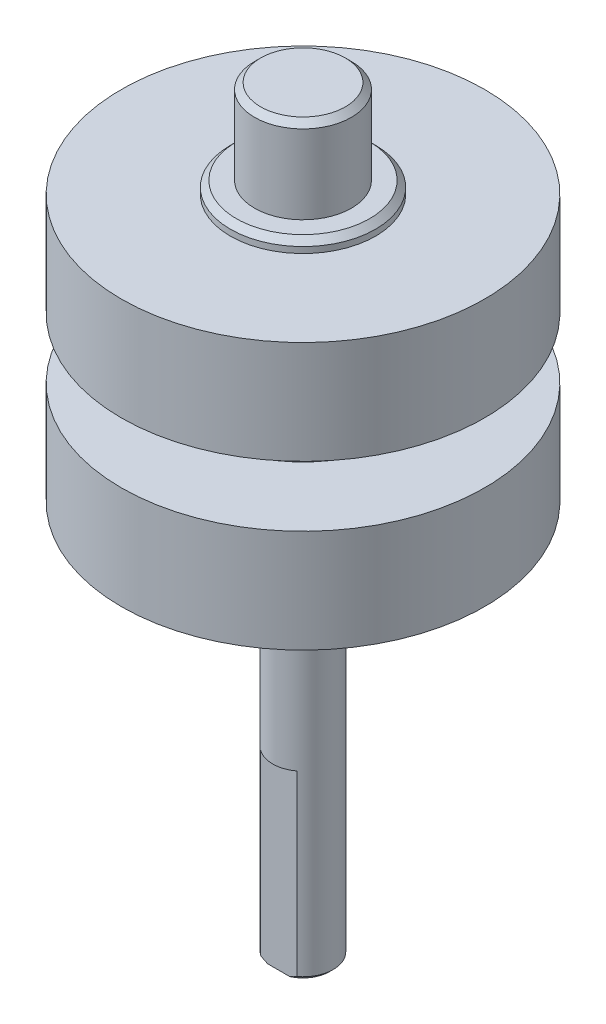
ISO-10303-21;
HEADER;
FILE_DESCRIPTION(('STEP AP214'),'2;1');
FILE_NAME('part.step','',(''),(''),'','','');
FILE_SCHEMA(('AUTOMOTIVE_DESIGN { 1 0 10303 214 1 1 1 1 }'));
ENDSEC;
DATA;
#1=APPLICATION_CONTEXT('core data for automotive mechanical design processes');
#2=APPLICATION_PROTOCOL_DEFINITION('international standard','automotive_design',2000,#1);
#3=PRODUCT_CONTEXT('',#1,'mechanical');
#4=PRODUCT('Part','Part','',(#3));
#5=PRODUCT_RELATED_PRODUCT_CATEGORY('part','',(#4));
#6=PRODUCT_DEFINITION_FORMATION('','',#4);
#7=PRODUCT_DEFINITION_CONTEXT('part definition',#1,'design');
#8=PRODUCT_DEFINITION('design','',#6,#7);
#9=PRODUCT_DEFINITION_SHAPE('','',#8);
#10=(LENGTH_UNIT() NAMED_UNIT(*) SI_UNIT(.MILLI.,.METRE.));
#11=(NAMED_UNIT(*) PLANE_ANGLE_UNIT() SI_UNIT($,.RADIAN.));
#12=(NAMED_UNIT(*) SI_UNIT($,.STERADIAN.) SOLID_ANGLE_UNIT());
#13=UNCERTAINTY_MEASURE_WITH_UNIT(LENGTH_MEASURE(1.E-05),#10,'distance_accuracy_value','');
#14=(GEOMETRIC_REPRESENTATION_CONTEXT(3) GLOBAL_UNCERTAINTY_ASSIGNED_CONTEXT((#13)) GLOBAL_UNIT_ASSIGNED_CONTEXT((#10,
#11,#12)) REPRESENTATION_CONTEXT('',''));
#15=CARTESIAN_POINT('',(0.,0.,0.));
#16=DIRECTION('',(0.,0.,1.));
#17=DIRECTION('',(1.,0.,0.));
#18=AXIS2_PLACEMENT_3D('',#15,#16,#17);
#19=CARTESIAN_POINT('',(0.,38.5,0.));
#20=DIRECTION('',(0.,1.,0.));
#21=DIRECTION('',(0.,0.,1.));
#22=AXIS2_PLACEMENT_3D('',#19,#20,#21);
#23=PLANE('',#22);
#24=CARTESIAN_POINT('',(0.,38.4999999999423,0.));
#25=DIRECTION('',(0.,-1.,0.));
#26=DIRECTION('',(0.,0.,-1.));
#27=AXIS2_PLACEMENT_3D('',#24,#25,#26);
#28=CIRCLE('',#27,3.50000000003092);
#29=CARTESIAN_POINT('',(0.,38.4999999999423,-3.50000000003095));
#30=VERTEX_POINT('',#29);
#31=EDGE_CURVE('E58',#30,#30,#28,.T.);
#32=ORIENTED_EDGE('',*,*,#31,.F.);
#33=EDGE_LOOP('',(#32));
#34=FACE_BOUND('',#33,.T.);
#35=ADVANCED_FACE('F16',(#34),#23,.T.);
#36=CARTESIAN_POINT('',(0.,-9.,2.25));
#37=DIRECTION('',(0.,1.,0.));
#38=DIRECTION('',(0.,0.,1.));
#39=AXIS2_PLACEMENT_3D('',#36,#37,#38);
#40=PLANE('',#39);
#41=CARTESIAN_POINT('',(0.,-9.,0.));
#42=DIRECTION('',(0.,1.,0.));
#43=DIRECTION('',(0.,0.,1.));
#44=AXIS2_PLACEMENT_3D('',#41,#42,#43);
#45=CIRCLE('',#44,2.5);
#46=CARTESIAN_POINT('',(-1.50000000000001,-9.,2.));
#47=VERTEX_POINT('',#46);
#48=CARTESIAN_POINT('',(1.50000000000001,-9.,2.));
#49=VERTEX_POINT('',#48);
#50=EDGE_CURVE('E19',#47,#49,#45,.T.);
#51=ORIENTED_EDGE('',*,*,#50,.F.);
#52=DIRECTION('',(1.,0.,0.));
#53=VECTOR('',#52,1.);
#54=CARTESIAN_POINT('',(2.,-9.,2.));
#55=LINE('',#54,#53);
#56=EDGE_CURVE('E59',#47,#49,#55,.T.);
#57=ORIENTED_EDGE('',*,*,#56,.T.);
#58=EDGE_LOOP('',(#51,#57));
#59=FACE_BOUND('',#58,.T.);
#60=ADVANCED_FACE('F60',(#59),#40,.F.);
#61=CARTESIAN_POINT('',(0.,-24.,0.));
#62=DIRECTION('',(0.,-1.,0.));
#63=DIRECTION('',(0.,0.,-1.));
#64=AXIS2_PLACEMENT_3D('',#61,#62,#63);
#65=PLANE('',#64);
#66=CARTESIAN_POINT('',(0.,-24.0000000000578,0.));
#67=DIRECTION('',(0.,1.,0.));
#68=DIRECTION('',(0.,0.,1.));
#69=AXIS2_PLACEMENT_3D('',#66,#67,#68);
#70=CIRCLE('',#69,2.20000000001617);
#71=CARTESIAN_POINT('',(0.916515139022164,-24.000000000061,2.00000000000001));
#72=VERTEX_POINT('',#71);
#73=CARTESIAN_POINT('',(-0.916515139099317,-24.0000000000289,2.00000000000001));
#74=VERTEX_POINT('',#73);
#75=EDGE_CURVE('E63',#72,#74,#70,.T.);
#76=ORIENTED_EDGE('',*,*,#75,.F.);
#77=DIRECTION('',(1.,0.,0.));
#78=VECTOR('',#77,1.);
#79=CARTESIAN_POINT('',(2.,-24.,2.00000000000001));
#80=LINE('',#79,#78);
#81=EDGE_CURVE('E124',#72,#74,#80,.F.);
#82=ORIENTED_EDGE('',*,*,#81,.T.);
#83=EDGE_LOOP('',(#76,#82));
#84=FACE_BOUND('',#83,.T.);
#85=ADVANCED_FACE('F140',(#84),#65,.T.);
#86=CARTESIAN_POINT('',(0.,38.0000000000678,0.));
#87=DIRECTION('',(0.,-1.,0.));
#88=DIRECTION('',(0.,0.,-1.));
#89=AXIS2_PLACEMENT_3D('',#86,#87,#88);
#90=CONICAL_SURFACE('',#89,3.99999999996229,0.785398163454291);
#91=CARTESIAN_POINT('',(0.,38.,0.));
#92=DIRECTION('',(0.,1.,0.));
#93=DIRECTION('',(0.,0.,1.));
#94=AXIS2_PLACEMENT_3D('',#91,#92,#93);
#95=CIRCLE('',#94,4.);
#96=CARTESIAN_POINT('',(0.,38.,3.99999999999997));
#97=VERTEX_POINT('',#96);
#98=EDGE_CURVE('E69',#97,#97,#95,.F.);
#99=ORIENTED_EDGE('',*,*,#98,.F.);
#100=EDGE_LOOP('',(#99));
#101=FACE_BOUND('',#100,.T.);
#102=ORIENTED_EDGE('',*,*,#31,.T.);
#103=EDGE_LOOP('',(#102));
#104=FACE_BOUND('',#103,.T.);
#105=ADVANCED_FACE('F136',(#101,#104),#90,.T.);
#106=CARTESIAN_POINT('',(0.,-23.7000000001331,0.));
#107=DIRECTION('',(0.,1.,0.));
#108=DIRECTION('',(0.,0.,1.));
#109=AXIS2_PLACEMENT_3D('',#106,#107,#108);
#110=CONICAL_SURFACE('',#109,2.49999999994086,0.785398163397449);
#111=CARTESIAN_POINT('',(-0.916515139012376,-24.0000000000596,1.99999999998915));
#112=CARTESIAN_POINT('',(-0.967075199471149,-23.9789289123364,1.99999999999609));
#113=CARTESIAN_POINT('',(-1.01711495184656,-23.9566498266611,1.99999999999895));
#114=CARTESIAN_POINT('',(-1.11615536642056,-23.9100464917321,2.00000000000106));
#115=CARTESIAN_POINT('',(-1.16515730452743,-23.8857249612041,2.00000000000031));
#116=CARTESIAN_POINT('',(-1.26224284758225,-23.8353572689511,1.99999999999971));
#117=CARTESIAN_POINT('',(-1.31032669400638,-23.8093115689974,1.99999999999986));
#118=CARTESIAN_POINT('',(-1.40573214740858,-23.7557142169136,2.00000000000016));
#119=CARTESIAN_POINT('',(-1.45305267268613,-23.7281606356308,2.00000000000031));
#120=CARTESIAN_POINT('',(-1.50000000003262,-23.7000000000544,2.00000000000001));
#121=B_SPLINE_CURVE_WITH_KNOTS('',3,(#111,#112,#113,#114,#115,#116,#117,#118,#119,#120),
.UNSPECIFIED.,.F.,.F.,(4,2,2,2,4),(0.,0.164287175656048,0.328359031365771,0.49238712135719,
0.656630208210139),.UNSPECIFIED.);
#122=CARTESIAN_POINT('',(-1.50000000001631,-23.7000000000272,2.00000000000001));
#123=VERTEX_POINT('',#122);
#124=EDGE_CURVE('E39',#74,#123,#121,.T.);
#125=ORIENTED_EDGE('',*,*,#124,.T.);
#126=CARTESIAN_POINT('',(0.,-23.7,0.));
#127=DIRECTION('',(0.,1.,0.));
#128=DIRECTION('',(0.,0.,1.));
#129=AXIS2_PLACEMENT_3D('',#126,#127,#128);
#130=CIRCLE('',#129,2.5);
#131=CARTESIAN_POINT('',(1.50000000001631,-23.7000000000272,2.00000000000001));
#132=VERTEX_POINT('',#131);
#133=EDGE_CURVE('E68',#132,#123,#130,.T.);
#134=ORIENTED_EDGE('',*,*,#133,.F.);
#135=CARTESIAN_POINT('',(1.50000000003262,-23.7000000000544,2.00000000000001));
#136=CARTESIAN_POINT('',(1.4530526726861,-23.7281606356306,2.00000000000001));
#137=CARTESIAN_POINT('',(1.40573214740862,-23.7557142169135,2.00000000000001));
#138=CARTESIAN_POINT('',(1.31032669400652,-23.8093115689974,2.00000000000001));
#139=CARTESIAN_POINT('',(1.26224284758244,-23.8353572689512,2.00000000000001));
#140=CARTESIAN_POINT('',(1.16515730452756,-23.8857249612038,2.00000000000001));
#141=CARTESIAN_POINT('',(1.1161553664206,-23.9100464917315,2.00000000000001));
#142=CARTESIAN_POINT('',(1.01711495184715,-23.9566498266614,2.00000000000001));
#143=CARTESIAN_POINT('',(0.967075199472374,-23.9789289123378,2.00000000000001));
#144=CARTESIAN_POINT('',(0.91651513901501,-24.000000000064,2.00000000000001));
#145=B_SPLINE_CURVE_WITH_KNOTS('',3,(#135,#136,#137,#138,#139,#140,#141,#142,#143,#144),
.UNSPECIFIED.,.F.,.F.,(4,2,2,2,4),(0.,0.164243086852827,0.328271176844211,0.492343032553758,
0.656630208209511),.UNSPECIFIED.);
#146=EDGE_CURVE('E62',#132,#72,#145,.T.);
#147=ORIENTED_EDGE('',*,*,#146,.T.);
#148=ORIENTED_EDGE('',*,*,#75,.T.);
#149=EDGE_LOOP('',(#125,#134,#147,#148));
#150=FACE_BOUND('',#149,.T.);
#151=ADVANCED_FACE('F132',(#150),#110,.T.);
#152=CARTESIAN_POINT('',(2.,-9.,2.));
#153=DIRECTION('',(0.,0.,-1.));
#154=DIRECTION('',(0.,1.,0.));
#155=AXIS2_PLACEMENT_3D('',#152,#153,#154);
#156=PLANE('',#155);
#157=ORIENTED_EDGE('',*,*,#124,.F.);
#158=ORIENTED_EDGE('',*,*,#81,.F.);
#159=ORIENTED_EDGE('',*,*,#146,.F.);
#160=DIRECTION('',(0.,1.,0.));
#161=VECTOR('',#160,1.);
#162=CARTESIAN_POINT('',(1.5,-23.7,2.00000000000002));
#163=LINE('',#162,#161);
#164=EDGE_CURVE('E56',#49,#132,#163,.F.);
#165=ORIENTED_EDGE('',*,*,#164,.F.);
#166=ORIENTED_EDGE('',*,*,#56,.F.);
#167=DIRECTION('',(0.,1.,0.));
#168=VECTOR('',#167,1.);
#169=CARTESIAN_POINT('',(-1.50000000000001,-23.7,2.00000000000001));
#170=LINE('',#169,#168);
#171=EDGE_CURVE('E57',#123,#47,#170,.T.);
#172=ORIENTED_EDGE('',*,*,#171,.F.);
#173=EDGE_LOOP('',(#157,#158,#159,#165,#166,#172));
#174=FACE_BOUND('',#173,.T.);
#175=ADVANCED_FACE('F65',(#174),#156,.F.);
#176=CARTESIAN_POINT('',(0.,31.5,0.));
#177=DIRECTION('',(0.,1.,0.));
#178=DIRECTION('',(0.,0.,1.));
#179=AXIS2_PLACEMENT_3D('',#176,#177,#178);
#180=CYLINDRICAL_SURFACE('',#179,4.);
#181=ORIENTED_EDGE('',*,*,#98,.T.);
#182=EDGE_LOOP('',(#181));
#183=FACE_BOUND('',#182,.T.);
#184=CARTESIAN_POINT('',(0.,31.5,0.));
#185=DIRECTION('',(0.,1.,0.));
#186=DIRECTION('',(0.,0.,1.));
#187=AXIS2_PLACEMENT_3D('',#184,#185,#186);
#188=CIRCLE('',#187,4.);
#189=CARTESIAN_POINT('',(0.,31.5,3.99999999999998));
#190=VERTEX_POINT('',#189);
#191=EDGE_CURVE('E114',#190,#190,#188,.F.);
#192=ORIENTED_EDGE('',*,*,#191,.F.);
#193=EDGE_LOOP('',(#192));
#194=FACE_BOUND('',#193,.T.);
#195=ADVANCED_FACE('F219',(#183,#194),#180,.T.);
#196=CARTESIAN_POINT('',(0.,-23.7,0.));
#197=DIRECTION('',(0.,1.,0.));
#198=DIRECTION('',(0.,0.,1.));
#199=AXIS2_PLACEMENT_3D('',#196,#197,#198);
#200=CYLINDRICAL_SURFACE('',#199,2.5);
#201=CARTESIAN_POINT('',(0.,0.499999999999997,0.));
#202=DIRECTION('',(0.,1.,0.));
#203=DIRECTION('',(0.,0.,1.));
#204=AXIS2_PLACEMENT_3D('',#201,#202,#203);
#205=CIRCLE('',#204,2.5);
#206=CARTESIAN_POINT('',(0.,0.499999999999999,2.5));
#207=VERTEX_POINT('',#206);
#208=EDGE_CURVE('E111',#207,#207,#205,.T.);
#209=ORIENTED_EDGE('',*,*,#208,.F.);
#210=EDGE_LOOP('',(#209));
#211=FACE_BOUND('',#210,.T.);
#212=ORIENTED_EDGE('',*,*,#171,.T.);
#213=ORIENTED_EDGE('',*,*,#50,.T.);
#214=ORIENTED_EDGE('',*,*,#164,.T.);
#215=ORIENTED_EDGE('',*,*,#133,.T.);
#216=EDGE_LOOP('',(#212,#213,#214,#215));
#217=FACE_BOUND('',#216,.T.);
#218=ADVANCED_FACE('F53',(#211,#217),#200,.T.);
#219=CARTESIAN_POINT('',(0.,31.5,0.));
#220=DIRECTION('',(0.,1.,0.));
#221=DIRECTION('',(0.,0.,1.));
#222=AXIS2_PLACEMENT_3D('',#219,#220,#221);
#223=PLANE('',#222);
#224=ORIENTED_EDGE('',*,*,#191,.T.);
#225=EDGE_LOOP('',(#224));
#226=FACE_BOUND('',#225,.T.);
#227=CARTESIAN_POINT('',(0.,31.4999999999941,0.));
#228=DIRECTION('',(0.,-1.,0.));
#229=DIRECTION('',(0.,0.,-1.));
#230=AXIS2_PLACEMENT_3D('',#227,#228,#229);
#231=CIRCLE('',#230,5.49999999998366);
#232=CARTESIAN_POINT('',(0.,31.4999999999941,-5.49999999998369));
#233=VERTEX_POINT('',#232);
#234=EDGE_CURVE('E108',#233,#233,#231,.T.);
#235=ORIENTED_EDGE('',*,*,#234,.F.);
#236=EDGE_LOOP('',(#235));
#237=FACE_BOUND('',#236,.T.);
#238=ADVANCED_FACE('F213',(#226,#237),#223,.T.);
#239=CARTESIAN_POINT('',(0.,0.5,0.));
#240=DIRECTION('',(0.,-1.,0.));
#241=DIRECTION('',(0.,0.,-1.));
#242=AXIS2_PLACEMENT_3D('',#239,#240,#241);
#243=PLANE('',#242);
#244=CARTESIAN_POINT('',(0.,0.499999999988173,0.));
#245=DIRECTION('',(0.,1.,0.));
#246=DIRECTION('',(0.,0.,1.));
#247=AXIS2_PLACEMENT_3D('',#244,#245,#246);
#248=CIRCLE('',#247,3.49999999997408);
#249=CARTESIAN_POINT('',(0.,0.499999999988176,3.49999999997408));
#250=VERTEX_POINT('',#249);
#251=EDGE_CURVE('E104',#250,#250,#248,.T.);
#252=ORIENTED_EDGE('',*,*,#251,.F.);
#253=EDGE_LOOP('',(#252));
#254=FACE_BOUND('',#253,.T.);
#255=ORIENTED_EDGE('',*,*,#208,.T.);
#256=EDGE_LOOP('',(#255));
#257=FACE_BOUND('',#256,.T.);
#258=ADVANCED_FACE('F209',(#254,#257),#243,.T.);
#259=CARTESIAN_POINT('',(0.,30.9999999999491,0.));
#260=DIRECTION('',(0.,-1.,0.));
#261=DIRECTION('',(0.,0.,-1.));
#262=AXIS2_PLACEMENT_3D('',#259,#260,#261);
#263=CONICAL_SURFACE('',#262,5.99999999997183,0.785398163340604);
#264=ORIENTED_EDGE('',*,*,#234,.T.);
#265=EDGE_LOOP('',(#264));
#266=FACE_BOUND('',#265,.T.);
#267=CARTESIAN_POINT('',(0.,31.,0.));
#268=DIRECTION('',(0.,1.,0.));
#269=DIRECTION('',(0.,0.,1.));
#270=AXIS2_PLACEMENT_3D('',#267,#268,#269);
#271=CIRCLE('',#270,6.);
#272=CARTESIAN_POINT('',(0.,31.,5.99999999999998));
#273=VERTEX_POINT('',#272);
#274=EDGE_CURVE('E107',#273,#273,#271,.F.);
#275=ORIENTED_EDGE('',*,*,#274,.F.);
#276=EDGE_LOOP('',(#275));
#277=FACE_BOUND('',#276,.T.);
#278=ADVANCED_FACE('F205',(#266,#277),#263,.T.);
#279=CARTESIAN_POINT('',(0.,0.999999999919506,0.));
#280=DIRECTION('',(0.,1.,0.));
#281=DIRECTION('',(0.,0.,1.));
#282=AXIS2_PLACEMENT_3D('',#279,#280,#281);
#283=CONICAL_SURFACE('',#282,3.99999999990541,0.785398163397449);
#284=CARTESIAN_POINT('',(0.,0.999999999999997,0.));
#285=DIRECTION('',(0.,1.,0.));
#286=DIRECTION('',(0.,0.,1.));
#287=AXIS2_PLACEMENT_3D('',#284,#285,#286);
#288=CIRCLE('',#287,4.);
#289=CARTESIAN_POINT('',(0.,1.,4.));
#290=VERTEX_POINT('',#289);
#291=EDGE_CURVE('E103',#290,#290,#288,.T.);
#292=ORIENTED_EDGE('',*,*,#291,.F.);
#293=EDGE_LOOP('',(#292));
#294=FACE_BOUND('',#293,.T.);
#295=ORIENTED_EDGE('',*,*,#251,.T.);
#296=EDGE_LOOP('',(#295));
#297=FACE_BOUND('',#296,.T.);
#298=ADVANCED_FACE('F201',(#294,#297),#283,.T.);
#299=CARTESIAN_POINT('',(0.,30.5,0.));
#300=DIRECTION('',(0.,1.,0.));
#301=DIRECTION('',(0.,0.,1.));
#302=AXIS2_PLACEMENT_3D('',#299,#300,#301);
#303=CYLINDRICAL_SURFACE('',#302,6.);
#304=ORIENTED_EDGE('',*,*,#274,.T.);
#305=EDGE_LOOP('',(#304));
#306=FACE_BOUND('',#305,.T.);
#307=CARTESIAN_POINT('',(0.,30.5,0.));
#308=DIRECTION('',(0.,1.,0.));
#309=DIRECTION('',(0.,0.,1.));
#310=AXIS2_PLACEMENT_3D('',#307,#308,#309);
#311=CIRCLE('',#310,6.);
#312=CARTESIAN_POINT('',(0.,30.5,5.99999999999998));
#313=VERTEX_POINT('',#312);
#314=EDGE_CURVE('E100',#313,#313,#311,.F.);
#315=ORIENTED_EDGE('',*,*,#314,.F.);
#316=EDGE_LOOP('',(#315));
#317=FACE_BOUND('',#316,.T.);
#318=ADVANCED_FACE('F197',(#306,#317),#303,.T.);
#319=CARTESIAN_POINT('',(0.,1.,0.));
#320=DIRECTION('',(0.,1.,0.));
#321=DIRECTION('',(0.,0.,1.));
#322=AXIS2_PLACEMENT_3D('',#319,#320,#321);
#323=CYLINDRICAL_SURFACE('',#322,4.);
#324=CARTESIAN_POINT('',(0.,7.5,0.));
#325=DIRECTION('',(0.,1.,0.));
#326=DIRECTION('',(0.,0.,1.));
#327=AXIS2_PLACEMENT_3D('',#324,#325,#326);
#328=CIRCLE('',#327,4.);
#329=CARTESIAN_POINT('',(0.,7.5,3.99999999999999));
#330=VERTEX_POINT('',#329);
#331=EDGE_CURVE('E97',#330,#330,#328,.T.);
#332=ORIENTED_EDGE('',*,*,#331,.F.);
#333=EDGE_LOOP('',(#332));
#334=FACE_BOUND('',#333,.T.);
#335=ORIENTED_EDGE('',*,*,#291,.T.);
#336=EDGE_LOOP('',(#335));
#337=FACE_BOUND('',#336,.T.);
#338=ADVANCED_FACE('F193',(#334,#337),#323,.T.);
#339=CARTESIAN_POINT('',(0.,30.5,0.));
#340=DIRECTION('',(0.,1.,0.));
#341=DIRECTION('',(0.,0.,1.));
#342=AXIS2_PLACEMENT_3D('',#339,#340,#341);
#343=PLANE('',#342);
#344=ORIENTED_EDGE('',*,*,#314,.T.);
#345=EDGE_LOOP('',(#344));
#346=FACE_BOUND('',#345,.T.);
#347=CARTESIAN_POINT('',(0.,30.5,0.));
#348=DIRECTION('',(0.,1.,0.));
#349=DIRECTION('',(0.,0.,1.));
#350=AXIS2_PLACEMENT_3D('',#347,#348,#349);
#351=CIRCLE('',#350,15.);
#352=CARTESIAN_POINT('',(0.,30.5,15.));
#353=VERTEX_POINT('',#352);
#354=EDGE_CURVE('E94',#353,#353,#351,.F.);
#355=ORIENTED_EDGE('',*,*,#354,.F.);
#356=EDGE_LOOP('',(#355));
#357=FACE_BOUND('',#356,.T.);
#358=ADVANCED_FACE('F189',(#346,#357),#343,.T.);
#359=CARTESIAN_POINT('',(0.,7.5,0.));
#360=DIRECTION('',(0.,-1.,0.));
#361=DIRECTION('',(0.,0.,-1.));
#362=AXIS2_PLACEMENT_3D('',#359,#360,#361);
#363=PLANE('',#362);
#364=CARTESIAN_POINT('',(0.,7.50000000005001,0.));
#365=DIRECTION('',(0.,1.,0.));
#366=DIRECTION('',(0.,0.,1.));
#367=AXIS2_PLACEMENT_3D('',#364,#365,#366);
#368=CIRCLE('',#367,5.49999999998363);
#369=CARTESIAN_POINT('',(0.,7.50000000005002,5.49999999998362));
#370=VERTEX_POINT('',#369);
#371=EDGE_CURVE('E91',#370,#370,#368,.T.);
#372=ORIENTED_EDGE('',*,*,#371,.F.);
#373=EDGE_LOOP('',(#372));
#374=FACE_BOUND('',#373,.T.);
#375=ORIENTED_EDGE('',*,*,#331,.T.);
#376=EDGE_LOOP('',(#375));
#377=FACE_BOUND('',#376,.T.);
#378=ADVANCED_FACE('F185',(#374,#377),#363,.T.);
#379=CARTESIAN_POINT('',(0.,22.,0.));
#380=DIRECTION('',(0.,1.,0.));
#381=DIRECTION('',(0.,0.,1.));
#382=AXIS2_PLACEMENT_3D('',#379,#380,#381);
#383=CYLINDRICAL_SURFACE('',#382,15.);
#384=ORIENTED_EDGE('',*,*,#354,.T.);
#385=EDGE_LOOP('',(#384));
#386=FACE_BOUND('',#385,.T.);
#387=CARTESIAN_POINT('',(0.,22.,0.));
#388=DIRECTION('',(0.,1.,0.));
#389=DIRECTION('',(0.,0.,1.));
#390=AXIS2_PLACEMENT_3D('',#387,#388,#389);
#391=CIRCLE('',#390,15.);
#392=CARTESIAN_POINT('',(0.,22.,15.));
#393=VERTEX_POINT('',#392);
#394=EDGE_CURVE('E88',#393,#393,#391,.T.);
#395=ORIENTED_EDGE('',*,*,#394,.T.);
#396=EDGE_LOOP('',(#395));
#397=FACE_BOUND('',#396,.T.);
#398=ADVANCED_FACE('F181',(#386,#397),#383,.T.);
#399=CARTESIAN_POINT('',(0.,7.99999999998135,0.));
#400=DIRECTION('',(0.,1.,0.));
#401=DIRECTION('',(0.,0.,1.));
#402=AXIS2_PLACEMENT_3D('',#399,#400,#401);
#403=CONICAL_SURFACE('',#402,5.99999999991497,0.785398163397449);
#404=CARTESIAN_POINT('',(0.,7.99999999999999,0.));
#405=DIRECTION('',(0.,1.,0.));
#406=DIRECTION('',(0.,0.,1.));
#407=AXIS2_PLACEMENT_3D('',#404,#405,#406);
#408=CIRCLE('',#407,6.);
#409=CARTESIAN_POINT('',(0.,8.,5.99999999999999));
#410=VERTEX_POINT('',#409);
#411=EDGE_CURVE('E87',#410,#410,#408,.T.);
#412=ORIENTED_EDGE('',*,*,#411,.F.);
#413=EDGE_LOOP('',(#412));
#414=FACE_BOUND('',#413,.T.);
#415=ORIENTED_EDGE('',*,*,#371,.T.);
#416=EDGE_LOOP('',(#415));
#417=FACE_BOUND('',#416,.T.);
#418=ADVANCED_FACE('F177',(#414,#417),#403,.T.);
#419=CARTESIAN_POINT('',(0.,22.,0.));
#420=DIRECTION('',(0.,1.,0.));
#421=DIRECTION('',(0.,0.,1.));
#422=AXIS2_PLACEMENT_3D('',#419,#420,#421);
#423=PLANE('',#422);
#424=CARTESIAN_POINT('',(0.,22.,0.));
#425=DIRECTION('',(0.,-1.,0.));
#426=DIRECTION('',(0.,0.,-1.));
#427=AXIS2_PLACEMENT_3D('',#424,#425,#426);
#428=CIRCLE('',#427,8.);
#429=CARTESIAN_POINT('',(0.,22.,-8.00000000000002));
#430=VERTEX_POINT('',#429);
#431=EDGE_CURVE('E84',#430,#430,#428,.T.);
#432=ORIENTED_EDGE('',*,*,#431,.F.);
#433=EDGE_LOOP('',(#432));
#434=FACE_BOUND('',#433,.T.);
#435=ORIENTED_EDGE('',*,*,#394,.F.);
#436=EDGE_LOOP('',(#435));
#437=FACE_BOUND('',#436,.T.);
#438=ADVANCED_FACE('F173',(#434,#437),#423,.F.);
#439=CARTESIAN_POINT('',(0.,8.,0.));
#440=DIRECTION('',(0.,1.,0.));
#441=DIRECTION('',(0.,0.,1.));
#442=AXIS2_PLACEMENT_3D('',#439,#440,#441);
#443=CYLINDRICAL_SURFACE('',#442,6.);
#444=CARTESIAN_POINT('',(0.,8.49999999999999,0.));
#445=DIRECTION('',(0.,1.,0.));
#446=DIRECTION('',(0.,0.,1.));
#447=AXIS2_PLACEMENT_3D('',#444,#445,#446);
#448=CIRCLE('',#447,6.);
#449=CARTESIAN_POINT('',(0.,8.5,5.99999999999999));
#450=VERTEX_POINT('',#449);
#451=EDGE_CURVE('E81',#450,#450,#448,.T.);
#452=ORIENTED_EDGE('',*,*,#451,.F.);
#453=EDGE_LOOP('',(#452));
#454=FACE_BOUND('',#453,.T.);
#455=ORIENTED_EDGE('',*,*,#411,.T.);
#456=EDGE_LOOP('',(#455));
#457=FACE_BOUND('',#456,.T.);
#458=ADVANCED_FACE('F169',(#454,#457),#443,.T.);
#459=CARTESIAN_POINT('',(0.,22.,0.));
#460=DIRECTION('',(0.,-1.,0.));
#461=DIRECTION('',(0.,0.,-1.));
#462=AXIS2_PLACEMENT_3D('',#459,#460,#461);
#463=CYLINDRICAL_SURFACE('',#462,8.);
#464=CARTESIAN_POINT('',(0.,17.,0.));
#465=DIRECTION('',(0.,-1.,0.));
#466=DIRECTION('',(0.,0.,-1.));
#467=AXIS2_PLACEMENT_3D('',#464,#465,#466);
#468=CIRCLE('',#467,8.);
#469=CARTESIAN_POINT('',(0.,17.,-8.00000000000001));
#470=VERTEX_POINT('',#469);
#471=EDGE_CURVE('E78',#470,#470,#468,.F.);
#472=ORIENTED_EDGE('',*,*,#471,.T.);
#473=EDGE_LOOP('',(#472));
#474=FACE_BOUND('',#473,.T.);
#475=ORIENTED_EDGE('',*,*,#431,.T.);
#476=EDGE_LOOP('',(#475));
#477=FACE_BOUND('',#476,.T.);
#478=ADVANCED_FACE('F165',(#474,#477),#463,.T.);
#479=CARTESIAN_POINT('',(0.,8.5,0.));
#480=DIRECTION('',(0.,-1.,0.));
#481=DIRECTION('',(0.,0.,-1.));
#482=AXIS2_PLACEMENT_3D('',#479,#480,#481);
#483=PLANE('',#482);
#484=CARTESIAN_POINT('',(0.,8.49999999999999,0.));
#485=DIRECTION('',(0.,1.,0.));
#486=DIRECTION('',(0.,0.,1.));
#487=AXIS2_PLACEMENT_3D('',#484,#485,#486);
#488=CIRCLE('',#487,15.);
#489=CARTESIAN_POINT('',(0.,8.5,15.));
#490=VERTEX_POINT('',#489);
#491=EDGE_CURVE('E24',#490,#490,#488,.T.);
#492=ORIENTED_EDGE('',*,*,#491,.F.);
#493=EDGE_LOOP('',(#492));
#494=FACE_BOUND('',#493,.T.);
#495=ORIENTED_EDGE('',*,*,#451,.T.);
#496=EDGE_LOOP('',(#495));
#497=FACE_BOUND('',#496,.T.);
#498=ADVANCED_FACE('F158',(#494,#497),#483,.T.);
#499=CARTESIAN_POINT('',(0.,17.,0.));
#500=DIRECTION('',(0.,-1.,0.));
#501=DIRECTION('',(0.,0.,-1.));
#502=AXIS2_PLACEMENT_3D('',#499,#500,#501);
#503=PLANE('',#502);
#504=CARTESIAN_POINT('',(0.,17.,0.));
#505=DIRECTION('',(0.,1.,0.));
#506=DIRECTION('',(0.,0.,1.));
#507=AXIS2_PLACEMENT_3D('',#504,#505,#506);
#508=CIRCLE('',#507,15.);
#509=CARTESIAN_POINT('',(0.,17.,15.));
#510=VERTEX_POINT('',#509);
#511=EDGE_CURVE('E11',#510,#510,#508,.F.);
#512=ORIENTED_EDGE('',*,*,#511,.F.);
#513=EDGE_LOOP('',(#512));
#514=FACE_BOUND('',#513,.T.);
#515=ORIENTED_EDGE('',*,*,#471,.F.);
#516=EDGE_LOOP('',(#515));
#517=FACE_BOUND('',#516,.T.);
#518=ADVANCED_FACE('F152',(#514,#517),#503,.F.);
#519=CARTESIAN_POINT('',(0.,8.5,0.));
#520=DIRECTION('',(0.,1.,0.));
#521=DIRECTION('',(0.,0.,1.));
#522=AXIS2_PLACEMENT_3D('',#519,#520,#521);
#523=CYLINDRICAL_SURFACE('',#522,15.);
#524=ORIENTED_EDGE('',*,*,#511,.T.);
#525=EDGE_LOOP('',(#524));
#526=FACE_BOUND('',#525,.T.);
#527=ORIENTED_EDGE('',*,*,#491,.T.);
#528=EDGE_LOOP('',(#527));
#529=FACE_BOUND('',#528,.T.);
#530=ADVANCED_FACE('F150',(#526,#529),#523,.T.);
#531=CLOSED_SHELL('',(#35,#60,#85,#105,#151,#175,#195,#218,#238,#258,#278,#298,#318,#338,#358,
#378,#398,#418,#438,#458,#478,#498,#518,#530));
#532=MANIFOLD_SOLID_BREP('B1',#531);
#533=ADVANCED_BREP_SHAPE_REPRESENTATION('',(#18,#532),#14);
#534=SHAPE_DEFINITION_REPRESENTATION(#9,#533);
ENDSEC;
END-ISO-10303-21;
